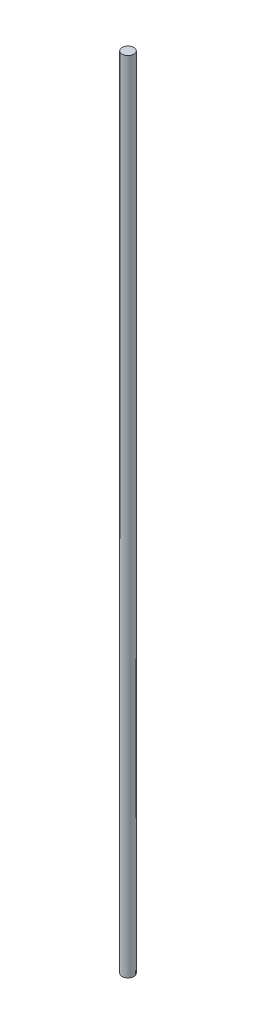
ISO-10303-21;
HEADER;
FILE_DESCRIPTION(('STEP AP214'),'2;1');
FILE_NAME('part.step','',(''),(''),'','','');
FILE_SCHEMA(('AUTOMOTIVE_DESIGN { 1 0 10303 214 1 1 1 1 }'));
ENDSEC;
DATA;
#1=APPLICATION_CONTEXT('core data for automotive mechanical design processes');
#2=APPLICATION_PROTOCOL_DEFINITION('international standard','automotive_design',2000,#1);
#3=PRODUCT_CONTEXT('',#1,'mechanical');
#4=PRODUCT('Part','Part','',(#3));
#5=PRODUCT_RELATED_PRODUCT_CATEGORY('part','',(#4));
#6=PRODUCT_DEFINITION_FORMATION('','',#4);
#7=PRODUCT_DEFINITION_CONTEXT('part definition',#1,'design');
#8=PRODUCT_DEFINITION('design','',#6,#7);
#9=PRODUCT_DEFINITION_SHAPE('','',#8);
#10=(LENGTH_UNIT() NAMED_UNIT(*) SI_UNIT(.MILLI.,.METRE.));
#11=(NAMED_UNIT(*) PLANE_ANGLE_UNIT() SI_UNIT($,.RADIAN.));
#12=(NAMED_UNIT(*) SI_UNIT($,.STERADIAN.) SOLID_ANGLE_UNIT());
#13=UNCERTAINTY_MEASURE_WITH_UNIT(LENGTH_MEASURE(1.E-05),#10,'distance_accuracy_value','');
#14=(GEOMETRIC_REPRESENTATION_CONTEXT(3) GLOBAL_UNCERTAINTY_ASSIGNED_CONTEXT((#13)) GLOBAL_UNIT_ASSIGNED_CONTEXT((#10,
#11,#12)) REPRESENTATION_CONTEXT('',''));
#15=CARTESIAN_POINT('',(0.,0.,0.));
#16=DIRECTION('',(0.,0.,1.));
#17=DIRECTION('',(1.,0.,0.));
#18=AXIS2_PLACEMENT_3D('',#15,#16,#17);
#19=CARTESIAN_POINT('',(0.,59.69,-0.693610212997644));
#20=DIRECTION('',(0.,-1.,0.));
#21=DIRECTION('',(0.,0.,-1.));
#22=AXIS2_PLACEMENT_3D('',#19,#20,#21);
#23=CYLINDRICAL_SURFACE('',#22,0.3175);
#24=CARTESIAN_POINT('',(0.,59.69,-0.693610212997644));
#25=DIRECTION('',(0.,1.,0.));
#26=DIRECTION('',(0.,0.,1.));
#27=AXIS2_PLACEMENT_3D('',#24,#25,#26);
#28=CIRCLE('',#27,0.3175);
#29=CARTESIAN_POINT('',(0.,59.69,-0.376110212997644));
#30=VERTEX_POINT('',#29);
#31=EDGE_CURVE('E10',#30,#30,#28,.T.);
#32=ORIENTED_EDGE('',*,*,#31,.F.);
#33=EDGE_LOOP('',(#32));
#34=FACE_BOUND('',#33,.T.);
#35=CARTESIAN_POINT('',(0.,16.51,-0.693610212997644));
#36=DIRECTION('',(0.,1.,0.));
#37=DIRECTION('',(0.,0.,1.));
#38=AXIS2_PLACEMENT_3D('',#35,#36,#37);
#39=CIRCLE('',#38,0.3175);
#40=CARTESIAN_POINT('',(0.,16.51,-0.376110212997644));
#41=VERTEX_POINT('',#40);
#42=EDGE_CURVE('E34',#41,#41,#39,.T.);
#43=ORIENTED_EDGE('',*,*,#42,.T.);
#44=EDGE_LOOP('',(#43));
#45=FACE_BOUND('',#44,.T.);
#46=ADVANCED_FACE('F31',(#34,#45),#23,.T.);
#47=CARTESIAN_POINT('',(0.,59.69,-0.693610212997644));
#48=DIRECTION('',(0.,1.,0.));
#49=DIRECTION('',(0.,0.,1.));
#50=AXIS2_PLACEMENT_3D('',#47,#48,#49);
#51=PLANE('',#50);
#52=ORIENTED_EDGE('',*,*,#31,.T.);
#53=EDGE_LOOP('',(#52));
#54=FACE_BOUND('',#53,.T.);
#55=ADVANCED_FACE('F46',(#54),#51,.T.);
#56=CARTESIAN_POINT('',(0.,16.51,-0.693610212997644));
#57=DIRECTION('',(0.,1.,0.));
#58=DIRECTION('',(0.,0.,1.));
#59=AXIS2_PLACEMENT_3D('',#56,#57,#58);
#60=PLANE('',#59);
#61=ORIENTED_EDGE('',*,*,#42,.F.);
#62=EDGE_LOOP('',(#61));
#63=FACE_BOUND('',#62,.T.);
#64=ADVANCED_FACE('F44',(#63),#60,.F.);
#65=CLOSED_SHELL('',(#46,#55,#64));
#66=MANIFOLD_SOLID_BREP('B2',#65);
#67=ADVANCED_BREP_SHAPE_REPRESENTATION('',(#18,#66),#14);
#68=SHAPE_DEFINITION_REPRESENTATION(#9,#67);
ENDSEC;
END-ISO-10303-21;
